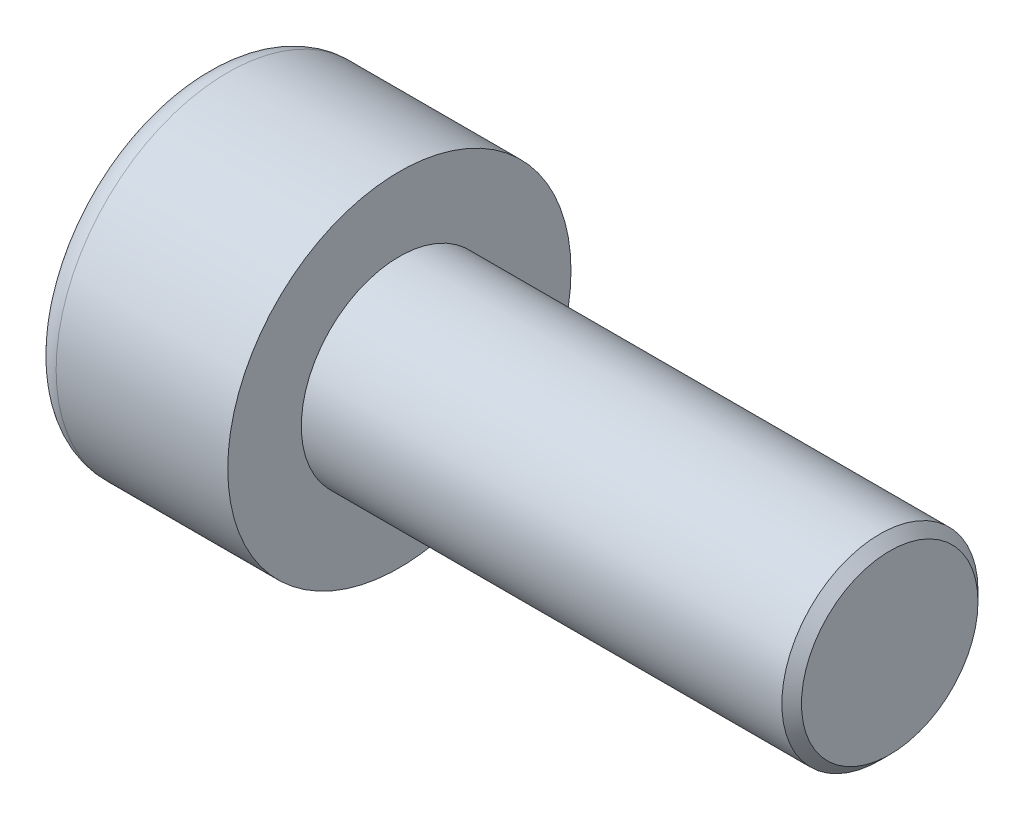
ISO-10303-21;
HEADER;
FILE_DESCRIPTION(('STEP AP214'),'2;1');
FILE_NAME('part.step','',(''),(''),'','','');
FILE_SCHEMA(('AUTOMOTIVE_DESIGN { 1 0 10303 214 1 1 1 1 }'));
ENDSEC;
DATA;
#1=APPLICATION_CONTEXT('core data for automotive mechanical design processes');
#2=APPLICATION_PROTOCOL_DEFINITION('international standard','automotive_design',2000,#1);
#3=PRODUCT_CONTEXT('',#1,'mechanical');
#4=PRODUCT('Part','Part','',(#3));
#5=PRODUCT_RELATED_PRODUCT_CATEGORY('part','',(#4));
#6=PRODUCT_DEFINITION_FORMATION('','',#4);
#7=PRODUCT_DEFINITION_CONTEXT('part definition',#1,'design');
#8=PRODUCT_DEFINITION('design','',#6,#7);
#9=PRODUCT_DEFINITION_SHAPE('','',#8);
#10=(LENGTH_UNIT() NAMED_UNIT(*) SI_UNIT(.MILLI.,.METRE.));
#11=(NAMED_UNIT(*) PLANE_ANGLE_UNIT() SI_UNIT($,.RADIAN.));
#12=(NAMED_UNIT(*) SI_UNIT($,.STERADIAN.) SOLID_ANGLE_UNIT());
#13=UNCERTAINTY_MEASURE_WITH_UNIT(LENGTH_MEASURE(1.E-05),#10,'distance_accuracy_value','');
#14=(GEOMETRIC_REPRESENTATION_CONTEXT(3) GLOBAL_UNCERTAINTY_ASSIGNED_CONTEXT((#13)) GLOBAL_UNIT_ASSIGNED_CONTEXT((#10,
#11,#12)) REPRESENTATION_CONTEXT('',''));
#15=CARTESIAN_POINT('',(0.,0.,0.));
#16=DIRECTION('',(0.,0.,1.));
#17=DIRECTION('',(1.,0.,0.));
#18=AXIS2_PLACEMENT_3D('',#15,#16,#17);
#19=CARTESIAN_POINT('',(2.,-3.,0.));
#20=DIRECTION('',(-1.,0.,0.));
#21=DIRECTION('',(0.,0.,1.));
#22=AXIS2_PLACEMENT_3D('',#19,#20,#21);
#23=PLANE('',#22);
#24=DIRECTION('',(0.,-0.866025403784438,-0.5));
#25=VECTOR('',#24,1.);
#26=CARTESIAN_POINT('',(2.,0.,1.73205080756888));
#27=LINE('',#26,#25);
#28=CARTESIAN_POINT('',(2.,-0.75,1.29903810567666));
#29=VERTEX_POINT('',#28);
#30=CARTESIAN_POINT('',(2.,-1.5,0.866025403784438));
#31=VERTEX_POINT('',#30);
#32=EDGE_CURVE('E159',#29,#31,#27,.T.);
#33=ORIENTED_EDGE('',*,*,#32,.F.);
#34=CARTESIAN_POINT('',(2.,0.,0.));
#35=DIRECTION('',(-1.,0.,0.));
#36=DIRECTION('',(0.,0.,1.));
#37=AXIS2_PLACEMENT_3D('',#34,#35,#36);
#38=CIRCLE('',#37,1.5);
#39=CARTESIAN_POINT('',(2.,-1.5,0.));
#40=VERTEX_POINT('',#39);
#41=EDGE_CURVE('E54',#29,#40,#38,.F.);
#42=ORIENTED_EDGE('',*,*,#41,.T.);
#43=DIRECTION('',(0.,0.,-1.));
#44=VECTOR('',#43,1.);
#45=CARTESIAN_POINT('',(2.,-1.5,0.866025403784438));
#46=LINE('',#45,#44);
#47=EDGE_CURVE('E164',#31,#40,#46,.T.);
#48=ORIENTED_EDGE('',*,*,#47,.F.);
#49=EDGE_LOOP('',(#33,#42,#48));
#50=FACE_BOUND('',#49,.T.);
#51=ADVANCED_FACE('F39',(#50),#23,.T.);
#52=CARTESIAN_POINT('',(2.,-1.5,-0.866025403784441));
#53=VERTEX_POINT('',#52);
#54=EDGE_CURVE('E163',#40,#53,#46,.T.);
#55=ORIENTED_EDGE('',*,*,#54,.F.);
#56=CARTESIAN_POINT('',(2.,-0.75,-1.29903810567666));
#57=VERTEX_POINT('',#56);
#58=EDGE_CURVE('E139',#40,#57,#38,.F.);
#59=ORIENTED_EDGE('',*,*,#58,.T.);
#60=DIRECTION('',(0.,0.866025403784439,-0.5));
#61=VECTOR('',#60,1.);
#62=CARTESIAN_POINT('',(2.,-1.5,-0.866025403784441));
#63=LINE('',#62,#61);
#64=EDGE_CURVE('E147',#53,#57,#63,.T.);
#65=ORIENTED_EDGE('',*,*,#64,.F.);
#66=EDGE_LOOP('',(#55,#59,#65));
#67=FACE_BOUND('',#66,.T.);
#68=ADVANCED_FACE('F220',(#67),#23,.T.);
#69=CARTESIAN_POINT('',(2.,0.,-1.73205080756888));
#70=VERTEX_POINT('',#69);
#71=EDGE_CURVE('E137',#57,#70,#63,.T.);
#72=ORIENTED_EDGE('',*,*,#71,.F.);
#73=CARTESIAN_POINT('',(2.,0.75,-1.29903810567666));
#74=VERTEX_POINT('',#73);
#75=EDGE_CURVE('E121',#57,#74,#38,.F.);
#76=ORIENTED_EDGE('',*,*,#75,.T.);
#77=DIRECTION('',(0.,0.866025403784439,0.5));
#78=VECTOR('',#77,1.);
#79=CARTESIAN_POINT('',(2.,0.,-1.73205080756888));
#80=LINE('',#79,#78);
#81=EDGE_CURVE('E135',#70,#74,#80,.T.);
#82=ORIENTED_EDGE('',*,*,#81,.F.);
#83=EDGE_LOOP('',(#72,#76,#82));
#84=FACE_BOUND('',#83,.T.);
#85=ADVANCED_FACE('F133',(#84),#23,.T.);
#86=CARTESIAN_POINT('',(2.,1.5,-0.866025403784438));
#87=VERTEX_POINT('',#86);
#88=EDGE_CURVE('E141',#74,#87,#80,.T.);
#89=ORIENTED_EDGE('',*,*,#88,.F.);
#90=CARTESIAN_POINT('',(2.,0.,0.));
#91=DIRECTION('',(1.,0.,0.));
#92=DIRECTION('',(0.,0.,-1.));
#93=AXIS2_PLACEMENT_3D('',#90,#91,#92);
#94=CIRCLE('',#93,1.5);
#95=CARTESIAN_POINT('',(2.,1.5,0.));
#96=VERTEX_POINT('',#95);
#97=EDGE_CURVE('E119',#74,#96,#94,.T.);
#98=ORIENTED_EDGE('',*,*,#97,.T.);
#99=DIRECTION('',(0.,0.,1.));
#100=VECTOR('',#99,1.);
#101=CARTESIAN_POINT('',(2.,1.5,-0.866025403784438));
#102=LINE('',#101,#100);
#103=EDGE_CURVE('E144',#87,#96,#102,.T.);
#104=ORIENTED_EDGE('',*,*,#103,.F.);
#105=EDGE_LOOP('',(#89,#98,#104));
#106=FACE_BOUND('',#105,.T.);
#107=ADVANCED_FACE('F142',(#106),#23,.T.);
#108=CARTESIAN_POINT('',(2.,1.5,0.866025403784438));
#109=VERTEX_POINT('',#108);
#110=EDGE_CURVE('E151',#96,#109,#102,.T.);
#111=ORIENTED_EDGE('',*,*,#110,.F.);
#112=CARTESIAN_POINT('',(2.,0.75,1.29903810567666));
#113=VERTEX_POINT('',#112);
#114=EDGE_CURVE('E124',#96,#113,#38,.F.);
#115=ORIENTED_EDGE('',*,*,#114,.T.);
#116=DIRECTION('',(0.,-0.866025403784438,0.5));
#117=VECTOR('',#116,1.);
#118=CARTESIAN_POINT('',(2.,1.5,0.866025403784438));
#119=LINE('',#118,#117);
#120=EDGE_CURVE('E156',#109,#113,#119,.T.);
#121=ORIENTED_EDGE('',*,*,#120,.F.);
#122=EDGE_LOOP('',(#111,#115,#121));
#123=FACE_BOUND('',#122,.T.);
#124=ADVANCED_FACE('F232',(#123),#23,.T.);
#125=CARTESIAN_POINT('',(2.,0.,1.73205080756888));
#126=VERTEX_POINT('',#125);
#127=EDGE_CURVE('E155',#113,#126,#119,.T.);
#128=ORIENTED_EDGE('',*,*,#127,.F.);
#129=EDGE_CURVE('E200',#113,#29,#38,.F.);
#130=ORIENTED_EDGE('',*,*,#129,.T.);
#131=EDGE_CURVE('E160',#126,#29,#27,.T.);
#132=ORIENTED_EDGE('',*,*,#131,.F.);
#133=EDGE_LOOP('',(#128,#130,#132));
#134=FACE_BOUND('',#133,.T.);
#135=ADVANCED_FACE('F223',(#134),#23,.T.);
#136=CARTESIAN_POINT('',(0.,0.,0.));
#137=DIRECTION('',(1.,0.,0.));
#138=DIRECTION('',(0.,0.,-1.));
#139=AXIS2_PLACEMENT_3D('',#136,#137,#138);
#140=PLANE('',#139);
#141=CARTESIAN_POINT('',(0.,0.,0.));
#142=DIRECTION('',(1.,0.,0.));
#143=DIRECTION('',(0.,0.,-1.));
#144=AXIS2_PLACEMENT_3D('',#141,#142,#143);
#145=CIRCLE('',#144,3.);
#146=CARTESIAN_POINT('',(0.,0.,-3.));
#147=VERTEX_POINT('',#146);
#148=EDGE_CURVE('E205',#147,#147,#145,.F.);
#149=ORIENTED_EDGE('',*,*,#148,.T.);
#150=EDGE_LOOP('',(#149));
#151=FACE_BOUND('',#150,.T.);
#152=DIRECTION('',(0.,0.866025403784439,-0.5));
#153=VECTOR('',#152,1.);
#154=CARTESIAN_POINT('',(0.,-1.5,-0.866025403784441));
#155=LINE('',#154,#153);
#156=CARTESIAN_POINT('',(0.,-1.5,-0.866025403784441));
#157=VERTEX_POINT('',#156);
#158=CARTESIAN_POINT('',(0.,0.,-1.73205080756888));
#159=VERTEX_POINT('',#158);
#160=EDGE_CURVE('E62',#157,#159,#155,.T.);
#161=ORIENTED_EDGE('',*,*,#160,.T.);
#162=DIRECTION('',(0.,0.866025403784439,0.5));
#163=VECTOR('',#162,1.);
#164=CARTESIAN_POINT('',(0.,0.,-1.73205080756888));
#165=LINE('',#164,#163);
#166=CARTESIAN_POINT('',(0.,1.5,-0.866025403784438));
#167=VERTEX_POINT('',#166);
#168=EDGE_CURVE('E169',#159,#167,#165,.T.);
#169=ORIENTED_EDGE('',*,*,#168,.T.);
#170=DIRECTION('',(0.,0.,1.));
#171=VECTOR('',#170,1.);
#172=CARTESIAN_POINT('',(0.,1.5,-0.866025403784438));
#173=LINE('',#172,#171);
#174=CARTESIAN_POINT('',(0.,1.5,0.866025403784438));
#175=VERTEX_POINT('',#174);
#176=EDGE_CURVE('E172',#167,#175,#173,.T.);
#177=ORIENTED_EDGE('',*,*,#176,.T.);
#178=DIRECTION('',(0.,-0.866025403784438,0.5));
#179=VECTOR('',#178,1.);
#180=CARTESIAN_POINT('',(0.,1.5,0.866025403784438));
#181=LINE('',#180,#179);
#182=CARTESIAN_POINT('',(0.,0.,1.73205080756888));
#183=VERTEX_POINT('',#182);
#184=EDGE_CURVE('E175',#175,#183,#181,.T.);
#185=ORIENTED_EDGE('',*,*,#184,.T.);
#186=DIRECTION('',(0.,-0.866025403784438,-0.5));
#187=VECTOR('',#186,1.);
#188=CARTESIAN_POINT('',(0.,0.,1.73205080756888));
#189=LINE('',#188,#187);
#190=CARTESIAN_POINT('',(0.,-1.5,0.866025403784438));
#191=VERTEX_POINT('',#190);
#192=EDGE_CURVE('E178',#183,#191,#189,.T.);
#193=ORIENTED_EDGE('',*,*,#192,.T.);
#194=DIRECTION('',(0.,0.,-1.));
#195=VECTOR('',#194,1.);
#196=CARTESIAN_POINT('',(0.,-1.5,0.866025403784438));
#197=LINE('',#196,#195);
#198=EDGE_CURVE('E181',#191,#157,#197,.T.);
#199=ORIENTED_EDGE('',*,*,#198,.T.);
#200=EDGE_LOOP('',(#161,#169,#177,#185,#193,#199));
#201=FACE_BOUND('',#200,.T.);
#202=ADVANCED_FACE('F231',(#151,#201),#140,.F.);
#203=CARTESIAN_POINT('',(4.,0.,0.));
#204=DIRECTION('',(1.,0.,0.));
#205=DIRECTION('',(0.,0.,-1.));
#206=AXIS2_PLACEMENT_3D('',#203,#204,#205);
#207=PLANE('',#206);
#208=CARTESIAN_POINT('',(4.,0.,0.));
#209=DIRECTION('',(1.,0.,0.));
#210=DIRECTION('',(0.,0.,-1.));
#211=AXIS2_PLACEMENT_3D('',#208,#209,#210);
#212=CIRCLE('',#211,3.5);
#213=CARTESIAN_POINT('',(4.,0.,-3.5));
#214=VERTEX_POINT('',#213);
#215=EDGE_CURVE('E197',#214,#214,#212,.T.);
#216=ORIENTED_EDGE('',*,*,#215,.T.);
#217=EDGE_LOOP('',(#216));
#218=FACE_BOUND('',#217,.T.);
#219=CARTESIAN_POINT('',(4.,0.,0.));
#220=DIRECTION('',(1.,0.,0.));
#221=DIRECTION('',(0.,0.,-1.));
#222=AXIS2_PLACEMENT_3D('',#219,#220,#221);
#223=CIRCLE('',#222,2.);
#224=CARTESIAN_POINT('',(4.,0.,-2.));
#225=VERTEX_POINT('',#224);
#226=EDGE_CURVE('E194',#225,#225,#223,.T.);
#227=ORIENTED_EDGE('',*,*,#226,.F.);
#228=EDGE_LOOP('',(#227));
#229=FACE_BOUND('',#228,.T.);
#230=ADVANCED_FACE('F238',(#218,#229),#207,.T.);
#231=CARTESIAN_POINT('',(4.,0.,0.));
#232=DIRECTION('',(-1.,0.,0.));
#233=DIRECTION('',(0.,0.,1.));
#234=AXIS2_PLACEMENT_3D('',#231,#232,#233);
#235=CYLINDRICAL_SURFACE('',#234,3.5);
#236=CARTESIAN_POINT('',(0.5,0.,0.));
#237=DIRECTION('',(1.,0.,0.));
#238=DIRECTION('',(0.,0.,-1.));
#239=AXIS2_PLACEMENT_3D('',#236,#237,#238);
#240=CIRCLE('',#239,3.5);
#241=CARTESIAN_POINT('',(0.5,0.,-3.5));
#242=VERTEX_POINT('',#241);
#243=EDGE_CURVE('E202',#242,#242,#240,.T.);
#244=ORIENTED_EDGE('',*,*,#243,.T.);
#245=EDGE_LOOP('',(#244));
#246=FACE_BOUND('',#245,.T.);
#247=ORIENTED_EDGE('',*,*,#215,.F.);
#248=EDGE_LOOP('',(#247));
#249=FACE_BOUND('',#248,.T.);
#250=ADVANCED_FACE('F283',(#246,#249),#235,.T.);
#251=CARTESIAN_POINT('',(14.,0.,0.));
#252=DIRECTION('',(-1.,0.,0.));
#253=DIRECTION('',(0.,0.,1.));
#254=AXIS2_PLACEMENT_3D('',#251,#252,#253);
#255=CYLINDRICAL_SURFACE('',#254,2.);
#256=CARTESIAN_POINT('',(13.8,0.,0.));
#257=DIRECTION('',(1.,0.,0.));
#258=DIRECTION('',(0.,0.,-1.));
#259=AXIS2_PLACEMENT_3D('',#256,#257,#258);
#260=CIRCLE('',#259,2.);
#261=CARTESIAN_POINT('',(13.8,0.,-2.));
#262=VERTEX_POINT('',#261);
#263=EDGE_CURVE('E11',#262,#262,#260,.F.);
#264=ORIENTED_EDGE('',*,*,#263,.T.);
#265=EDGE_LOOP('',(#264));
#266=FACE_BOUND('',#265,.T.);
#267=ORIENTED_EDGE('',*,*,#226,.T.);
#268=EDGE_LOOP('',(#267));
#269=FACE_BOUND('',#268,.T.);
#270=ADVANCED_FACE('F280',(#266,#269),#255,.T.);
#271=CARTESIAN_POINT('',(14.,0.,0.));
#272=DIRECTION('',(1.,0.,0.));
#273=DIRECTION('',(0.,0.,-1.));
#274=AXIS2_PLACEMENT_3D('',#271,#272,#273);
#275=PLANE('',#274);
#276=CARTESIAN_POINT('',(14.,0.,0.));
#277=DIRECTION('',(1.,0.,0.));
#278=DIRECTION('',(0.,0.,-1.));
#279=AXIS2_PLACEMENT_3D('',#276,#277,#278);
#280=CIRCLE('',#279,1.8);
#281=CARTESIAN_POINT('',(14.,0.,-1.8));
#282=VERTEX_POINT('',#281);
#283=EDGE_CURVE('E47',#282,#282,#280,.T.);
#284=ORIENTED_EDGE('',*,*,#283,.T.);
#285=EDGE_LOOP('',(#284));
#286=FACE_BOUND('',#285,.T.);
#287=ADVANCED_FACE('F210',(#286),#275,.T.);
#288=CARTESIAN_POINT('',(2.,-1.5,-0.866025403784441));
#289=DIRECTION('',(0.,0.5,0.866025403784439));
#290=DIRECTION('',(0.,-0.866025403784439,0.5));
#291=AXIS2_PLACEMENT_3D('',#288,#289,#290);
#292=PLANE('',#291);
#293=ORIENTED_EDGE('',*,*,#160,.F.);
#294=DIRECTION('',(-1.,0.,0.));
#295=VECTOR('',#294,1.);
#296=CARTESIAN_POINT('',(2.,-1.5,-0.866025403784441));
#297=LINE('',#296,#295);
#298=EDGE_CURVE('E167',#53,#157,#297,.T.);
#299=ORIENTED_EDGE('',*,*,#298,.F.);
#300=ORIENTED_EDGE('',*,*,#64,.T.);
#301=ORIENTED_EDGE('',*,*,#71,.T.);
#302=DIRECTION('',(-1.,0.,0.));
#303=VECTOR('',#302,1.);
#304=CARTESIAN_POINT('',(2.,0.,-1.73205080756888));
#305=LINE('',#304,#303);
#306=EDGE_CURVE('E150',#70,#159,#305,.T.);
#307=ORIENTED_EDGE('',*,*,#306,.T.);
#308=EDGE_LOOP('',(#293,#299,#300,#301,#307));
#309=FACE_BOUND('',#308,.T.);
#310=ADVANCED_FACE('F254',(#309),#292,.T.);
#311=CARTESIAN_POINT('',(2.,0.,-1.73205080756888));
#312=DIRECTION('',(0.,-0.5,0.866025403784439));
#313=DIRECTION('',(0.,-0.866025403784439,-0.5));
#314=AXIS2_PLACEMENT_3D('',#311,#312,#313);
#315=PLANE('',#314);
#316=ORIENTED_EDGE('',*,*,#168,.F.);
#317=ORIENTED_EDGE('',*,*,#306,.F.);
#318=ORIENTED_EDGE('',*,*,#81,.T.);
#319=ORIENTED_EDGE('',*,*,#88,.T.);
#320=DIRECTION('',(-1.,0.,0.));
#321=VECTOR('',#320,1.);
#322=CARTESIAN_POINT('',(2.,1.5,-0.866025403784438));
#323=LINE('',#322,#321);
#324=EDGE_CURVE('E191',#87,#167,#323,.T.);
#325=ORIENTED_EDGE('',*,*,#324,.T.);
#326=EDGE_LOOP('',(#316,#317,#318,#319,#325));
#327=FACE_BOUND('',#326,.T.);
#328=ADVANCED_FACE('F149',(#327),#315,.T.);
#329=CARTESIAN_POINT('',(2.,1.5,-0.866025403784438));
#330=DIRECTION('',(0.,-1.,0.));
#331=DIRECTION('',(0.,0.,-1.));
#332=AXIS2_PLACEMENT_3D('',#329,#330,#331);
#333=PLANE('',#332);
#334=ORIENTED_EDGE('',*,*,#176,.F.);
#335=ORIENTED_EDGE('',*,*,#324,.F.);
#336=ORIENTED_EDGE('',*,*,#103,.T.);
#337=ORIENTED_EDGE('',*,*,#110,.T.);
#338=DIRECTION('',(-1.,0.,0.));
#339=VECTOR('',#338,1.);
#340=CARTESIAN_POINT('',(2.,1.5,0.866025403784438));
#341=LINE('',#340,#339);
#342=EDGE_CURVE('E189',#109,#175,#341,.T.);
#343=ORIENTED_EDGE('',*,*,#342,.T.);
#344=EDGE_LOOP('',(#334,#335,#336,#337,#343));
#345=FACE_BOUND('',#344,.T.);
#346=ADVANCED_FACE('F252',(#345),#333,.T.);
#347=CARTESIAN_POINT('',(2.,1.5,0.866025403784438));
#348=DIRECTION('',(0.,-0.5,-0.866025403784439));
#349=DIRECTION('',(0.,0.866025403784438,-0.5));
#350=AXIS2_PLACEMENT_3D('',#347,#348,#349);
#351=PLANE('',#350);
#352=ORIENTED_EDGE('',*,*,#184,.F.);
#353=ORIENTED_EDGE('',*,*,#342,.F.);
#354=ORIENTED_EDGE('',*,*,#120,.T.);
#355=ORIENTED_EDGE('',*,*,#127,.T.);
#356=DIRECTION('',(-1.,0.,0.));
#357=VECTOR('',#356,1.);
#358=CARTESIAN_POINT('',(2.,0.,1.73205080756888));
#359=LINE('',#358,#357);
#360=EDGE_CURVE('E187',#126,#183,#359,.T.);
#361=ORIENTED_EDGE('',*,*,#360,.T.);
#362=EDGE_LOOP('',(#352,#353,#354,#355,#361));
#363=FACE_BOUND('',#362,.T.);
#364=ADVANCED_FACE('F249',(#363),#351,.T.);
#365=CARTESIAN_POINT('',(2.,0.,1.73205080756888));
#366=DIRECTION('',(0.,0.5,-0.866025403784439));
#367=DIRECTION('',(0.,0.866025403784438,0.5));
#368=AXIS2_PLACEMENT_3D('',#365,#366,#367);
#369=PLANE('',#368);
#370=ORIENTED_EDGE('',*,*,#192,.F.);
#371=ORIENTED_EDGE('',*,*,#360,.F.);
#372=ORIENTED_EDGE('',*,*,#131,.T.);
#373=ORIENTED_EDGE('',*,*,#32,.T.);
#374=DIRECTION('',(-1.,0.,0.));
#375=VECTOR('',#374,1.);
#376=CARTESIAN_POINT('',(2.,-1.5,0.866025403784438));
#377=LINE('',#376,#375);
#378=EDGE_CURVE('E185',#31,#191,#377,.T.);
#379=ORIENTED_EDGE('',*,*,#378,.T.);
#380=EDGE_LOOP('',(#370,#371,#372,#373,#379));
#381=FACE_BOUND('',#380,.T.);
#382=ADVANCED_FACE('F263',(#381),#369,.T.);
#383=CARTESIAN_POINT('',(2.,-1.5,0.866025403784438));
#384=DIRECTION('',(0.,1.,0.));
#385=DIRECTION('',(0.,0.,1.));
#386=AXIS2_PLACEMENT_3D('',#383,#384,#385);
#387=PLANE('',#386);
#388=ORIENTED_EDGE('',*,*,#198,.F.);
#389=ORIENTED_EDGE('',*,*,#378,.F.);
#390=ORIENTED_EDGE('',*,*,#47,.T.);
#391=ORIENTED_EDGE('',*,*,#54,.T.);
#392=ORIENTED_EDGE('',*,*,#298,.T.);
#393=EDGE_LOOP('',(#388,#389,#390,#391,#392));
#394=FACE_BOUND('',#393,.T.);
#395=ADVANCED_FACE('F116',(#394),#387,.T.);
#396=CARTESIAN_POINT('',(2.,0.,0.));
#397=DIRECTION('',(-1.,0.,0.));
#398=DIRECTION('',(0.,0.,1.));
#399=AXIS2_PLACEMENT_3D('',#396,#397,#398);
#400=CONICAL_SURFACE('',#399,1.5,1.04719755119659);
#401=CARTESIAN_POINT('',(2.86602540378445,0.,0.));
#402=VERTEX_POINT('',#401);
#403=VERTEX_LOOP('',#402);
#404=FACE_BOUND('',#403,.T.);
#405=ORIENTED_EDGE('',*,*,#97,.F.);
#406=ORIENTED_EDGE('',*,*,#75,.F.);
#407=ORIENTED_EDGE('',*,*,#58,.F.);
#408=ORIENTED_EDGE('',*,*,#41,.F.);
#409=ORIENTED_EDGE('',*,*,#129,.F.);
#410=ORIENTED_EDGE('',*,*,#114,.F.);
#411=EDGE_LOOP('',(#405,#406,#407,#408,#409,#410));
#412=FACE_BOUND('',#411,.T.);
#413=ADVANCED_FACE('F113',(#404,#412),#400,.F.);
#414=CARTESIAN_POINT('',(0.5,0.,0.));
#415=DIRECTION('',(1.,0.,0.));
#416=DIRECTION('',(0.,0.,-1.));
#417=AXIS2_PLACEMENT_3D('',#414,#415,#416);
#418=TOROIDAL_SURFACE('',#417,3.,0.5);
#419=ORIENTED_EDGE('',*,*,#148,.F.);
#420=EDGE_LOOP('',(#419));
#421=FACE_BOUND('',#420,.T.);
#422=ORIENTED_EDGE('',*,*,#243,.F.);
#423=EDGE_LOOP('',(#422));
#424=FACE_BOUND('',#423,.T.);
#425=ADVANCED_FACE('F115',(#421,#424),#418,.T.);
#426=CARTESIAN_POINT('',(14.,0.,0.));
#427=DIRECTION('',(-1.,0.,0.));
#428=DIRECTION('',(0.,0.,1.));
#429=AXIS2_PLACEMENT_3D('',#426,#427,#428);
#430=CONICAL_SURFACE('',#429,1.8,0.78539816339744);
#431=ORIENTED_EDGE('',*,*,#263,.F.);
#432=EDGE_LOOP('',(#431));
#433=FACE_BOUND('',#432,.T.);
#434=ORIENTED_EDGE('',*,*,#283,.F.);
#435=EDGE_LOOP('',(#434));
#436=FACE_BOUND('',#435,.T.);
#437=ADVANCED_FACE('F41',(#433,#436),#430,.T.);
#438=CLOSED_SHELL('',(#51,#68,#85,#107,#124,#135,#202,#230,#250,#270,#287,#310,#328,#346,#364,
#382,#395,#413,#425,#437));
#439=MANIFOLD_SOLID_BREP('B2',#438);
#440=ADVANCED_BREP_SHAPE_REPRESENTATION('',(#18,#439),#14);
#441=SHAPE_DEFINITION_REPRESENTATION(#9,#440);
ENDSEC;
END-ISO-10303-21;
